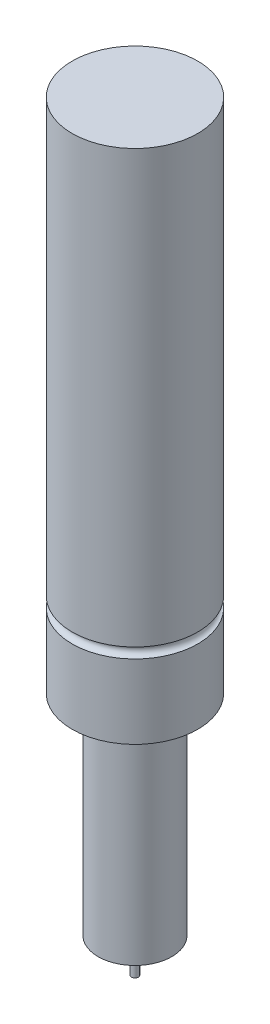
ISO-10303-21;
HEADER;
FILE_DESCRIPTION(('STEP AP214'),'2;1');
FILE_NAME('part.step','',(''),(''),'','','');
FILE_SCHEMA(('AUTOMOTIVE_DESIGN { 1 0 10303 214 1 1 1 1 }'));
ENDSEC;
DATA;
#1=APPLICATION_CONTEXT('core data for automotive mechanical design processes');
#2=APPLICATION_PROTOCOL_DEFINITION('international standard','automotive_design',2000,#1);
#3=PRODUCT_CONTEXT('',#1,'mechanical');
#4=PRODUCT('Part','Part','',(#3));
#5=PRODUCT_RELATED_PRODUCT_CATEGORY('part','',(#4));
#6=PRODUCT_DEFINITION_FORMATION('','',#4);
#7=PRODUCT_DEFINITION_CONTEXT('part definition',#1,'design');
#8=PRODUCT_DEFINITION('design','',#6,#7);
#9=PRODUCT_DEFINITION_SHAPE('','',#8);
#10=(LENGTH_UNIT() NAMED_UNIT(*) SI_UNIT(.MILLI.,.METRE.));
#11=(NAMED_UNIT(*) PLANE_ANGLE_UNIT() SI_UNIT($,.RADIAN.));
#12=(NAMED_UNIT(*) SI_UNIT($,.STERADIAN.) SOLID_ANGLE_UNIT());
#13=UNCERTAINTY_MEASURE_WITH_UNIT(LENGTH_MEASURE(1.E-05),#10,'distance_accuracy_value','');
#14=(GEOMETRIC_REPRESENTATION_CONTEXT(3) GLOBAL_UNCERTAINTY_ASSIGNED_CONTEXT((#13)) GLOBAL_UNIT_ASSIGNED_CONTEXT((#10,
#11,#12)) REPRESENTATION_CONTEXT('',''));
#15=CARTESIAN_POINT('',(0.,0.,0.));
#16=DIRECTION('',(0.,0.,1.));
#17=DIRECTION('',(1.,0.,0.));
#18=AXIS2_PLACEMENT_3D('',#15,#16,#17);
#19=CARTESIAN_POINT('',(0.,150.,0.));
#20=DIRECTION('',(0.,-1.,0.));
#21=DIRECTION('',(0.,0.,-1.));
#22=AXIS2_PLACEMENT_3D('',#19,#20,#21);
#23=CYLINDRICAL_SURFACE('',#22,18.25);
#24=CARTESIAN_POINT('',(0.,0.,0.));
#25=DIRECTION('',(0.,1.,0.));
#26=DIRECTION('',(0.,0.,1.));
#27=AXIS2_PLACEMENT_3D('',#24,#25,#26);
#28=CIRCLE('',#27,18.25);
#29=CARTESIAN_POINT('',(0.,0.,18.25));
#30=VERTEX_POINT('',#29);
#31=EDGE_CURVE('E66',#30,#30,#28,.T.);
#32=ORIENTED_EDGE('',*,*,#31,.T.);
#33=EDGE_LOOP('',(#32));
#34=FACE_BOUND('',#33,.T.);
#35=CARTESIAN_POINT('',(0.,21.5,0.));
#36=DIRECTION('',(0.,1.,0.));
#37=DIRECTION('',(0.,0.,1.));
#38=AXIS2_PLACEMENT_3D('',#35,#36,#37);
#39=CIRCLE('',#38,18.25);
#40=CARTESIAN_POINT('',(0.,21.5,18.25));
#41=VERTEX_POINT('',#40);
#42=EDGE_CURVE('E77',#41,#41,#39,.T.);
#43=ORIENTED_EDGE('',*,*,#42,.F.);
#44=EDGE_LOOP('',(#43));
#45=FACE_BOUND('',#44,.T.);
#46=ADVANCED_FACE('F45',(#34,#45),#23,.T.);
#47=CARTESIAN_POINT('',(0.,-61.,0.));
#48=DIRECTION('',(0.,1.,0.));
#49=DIRECTION('',(0.,0.,1.));
#50=AXIS2_PLACEMENT_3D('',#47,#48,#49);
#51=CYLINDRICAL_SURFACE('',#50,10.7);
#52=CARTESIAN_POINT('',(0.,-61.,0.));
#53=DIRECTION('',(0.,1.,0.));
#54=DIRECTION('',(0.,0.,1.));
#55=AXIS2_PLACEMENT_3D('',#52,#53,#54);
#56=CIRCLE('',#55,10.7);
#57=CARTESIAN_POINT('',(0.,-61.,10.7));
#58=VERTEX_POINT('',#57);
#59=EDGE_CURVE('E53',#58,#58,#56,.T.);
#60=ORIENTED_EDGE('',*,*,#59,.T.);
#61=EDGE_LOOP('',(#60));
#62=FACE_BOUND('',#61,.T.);
#63=CARTESIAN_POINT('',(0.,0.,0.));
#64=DIRECTION('',(0.,1.,0.));
#65=DIRECTION('',(0.,0.,1.));
#66=AXIS2_PLACEMENT_3D('',#63,#64,#65);
#67=CIRCLE('',#66,10.7);
#68=CARTESIAN_POINT('',(0.,0.,10.7));
#69=VERTEX_POINT('',#68);
#70=EDGE_CURVE('E58',#69,#69,#67,.T.);
#71=ORIENTED_EDGE('',*,*,#70,.F.);
#72=EDGE_LOOP('',(#71));
#73=FACE_BOUND('',#72,.T.);
#74=ADVANCED_FACE('F47',(#62,#73),#51,.T.);
#75=CARTESIAN_POINT('',(0.,-61.,0.));
#76=DIRECTION('',(0.,1.,0.));
#77=DIRECTION('',(0.,0.,1.));
#78=AXIS2_PLACEMENT_3D('',#75,#76,#77);
#79=PLANE('',#78);
#80=CARTESIAN_POINT('',(0.,-61.,0.));
#81=DIRECTION('',(0.,1.,0.));
#82=DIRECTION('',(0.,0.,1.));
#83=AXIS2_PLACEMENT_3D('',#80,#81,#82);
#84=CIRCLE('',#83,1.);
#85=CARTESIAN_POINT('',(0.,-61.,1.));
#86=VERTEX_POINT('',#85);
#87=EDGE_CURVE('E10',#86,#86,#84,.F.);
#88=ORIENTED_EDGE('',*,*,#87,.F.);
#89=EDGE_LOOP('',(#88));
#90=FACE_BOUND('',#89,.T.);
#91=ORIENTED_EDGE('',*,*,#59,.F.);
#92=EDGE_LOOP('',(#91));
#93=FACE_BOUND('',#92,.T.);
#94=ADVANCED_FACE('F109',(#90,#93),#79,.F.);
#95=CARTESIAN_POINT('',(0.,0.,0.));
#96=DIRECTION('',(0.,1.,0.));
#97=DIRECTION('',(0.,0.,1.));
#98=AXIS2_PLACEMENT_3D('',#95,#96,#97);
#99=PLANE('',#98);
#100=ORIENTED_EDGE('',*,*,#70,.T.);
#101=EDGE_LOOP('',(#100));
#102=FACE_BOUND('',#101,.T.);
#103=ORIENTED_EDGE('',*,*,#31,.F.);
#104=EDGE_LOOP('',(#103));
#105=FACE_BOUND('',#104,.T.);
#106=ADVANCED_FACE('F140',(#102,#105),#99,.F.);
#107=CARTESIAN_POINT('',(0.,-71.,0.));
#108=DIRECTION('',(0.,1.,0.));
#109=DIRECTION('',(0.,0.,1.));
#110=AXIS2_PLACEMENT_3D('',#107,#108,#109);
#111=CYLINDRICAL_SURFACE('',#110,1.);
#112=CARTESIAN_POINT('',(0.,-71.,0.));
#113=DIRECTION('',(0.,-1.,0.));
#114=DIRECTION('',(0.,0.,-1.));
#115=AXIS2_PLACEMENT_3D('',#112,#113,#114);
#116=CIRCLE('',#115,1.);
#117=CARTESIAN_POINT('',(0.,-71.,-1.));
#118=VERTEX_POINT('',#117);
#119=EDGE_CURVE('E70',#118,#118,#116,.T.);
#120=ORIENTED_EDGE('',*,*,#119,.F.);
#121=EDGE_LOOP('',(#120));
#122=FACE_BOUND('',#121,.T.);
#123=ORIENTED_EDGE('',*,*,#87,.T.);
#124=EDGE_LOOP('',(#123));
#125=FACE_BOUND('',#124,.T.);
#126=ADVANCED_FACE('F100',(#122,#125),#111,.T.);
#127=CARTESIAN_POINT('',(0.,-71.,0.));
#128=DIRECTION('',(0.,-1.,0.));
#129=DIRECTION('',(0.,0.,-1.));
#130=AXIS2_PLACEMENT_3D('',#127,#128,#129);
#131=PLANE('',#130);
#132=ORIENTED_EDGE('',*,*,#119,.T.);
#133=EDGE_LOOP('',(#132));
#134=FACE_BOUND('',#133,.T.);
#135=ADVANCED_FACE('F91',(#134),#131,.T.);
#136=CARTESIAN_POINT('',(0.,23.,0.));
#137=DIRECTION('',(0.,1.,0.));
#138=DIRECTION('',(0.,0.,1.));
#139=AXIS2_PLACEMENT_3D('',#136,#137,#138);
#140=TOROIDAL_SURFACE('',#139,18.25,1.5);
#141=ORIENTED_EDGE('',*,*,#42,.T.);
#142=EDGE_LOOP('',(#141));
#143=FACE_BOUND('',#142,.T.);
#144=CARTESIAN_POINT('',(0.,24.5,0.));
#145=DIRECTION('',(0.,1.,0.));
#146=DIRECTION('',(0.,0.,1.));
#147=AXIS2_PLACEMENT_3D('',#144,#145,#146);
#148=CIRCLE('',#147,18.25);
#149=CARTESIAN_POINT('',(0.,24.5,18.25));
#150=VERTEX_POINT('',#149);
#151=EDGE_CURVE('E81',#150,#150,#148,.T.);
#152=ORIENTED_EDGE('',*,*,#151,.F.);
#153=EDGE_LOOP('',(#152));
#154=FACE_BOUND('',#153,.T.);
#155=ADVANCED_FACE('F88',(#143,#154),#140,.F.);
#156=CARTESIAN_POINT('',(0.,150.,0.));
#157=DIRECTION('',(0.,1.,0.));
#158=DIRECTION('',(0.,0.,1.));
#159=AXIS2_PLACEMENT_3D('',#156,#157,#158);
#160=PLANE('',#159);
#161=CARTESIAN_POINT('',(0.,150.,0.));
#162=DIRECTION('',(0.,1.,0.));
#163=DIRECTION('',(0.,0.,1.));
#164=AXIS2_PLACEMENT_3D('',#161,#162,#163);
#165=CIRCLE('',#164,18.25);
#166=CARTESIAN_POINT('',(0.,150.,18.25));
#167=VERTEX_POINT('',#166);
#168=EDGE_CURVE('E64',#167,#167,#165,.T.);
#169=ORIENTED_EDGE('',*,*,#168,.T.);
#170=EDGE_LOOP('',(#169));
#171=FACE_BOUND('',#170,.T.);
#172=ADVANCED_FACE('F90',(#171),#160,.T.);
#173=ORIENTED_EDGE('',*,*,#168,.F.);
#174=EDGE_LOOP('',(#173));
#175=FACE_BOUND('',#174,.T.);
#176=ORIENTED_EDGE('',*,*,#151,.T.);
#177=EDGE_LOOP('',(#176));
#178=FACE_BOUND('',#177,.T.);
#179=ADVANCED_FACE('F86',(#175,#178),#23,.T.);
#180=CLOSED_SHELL('',(#46,#74,#94,#106,#126,#135,#155,#172,#179));
#181=MANIFOLD_SOLID_BREP('B2',#180);
#182=ADVANCED_BREP_SHAPE_REPRESENTATION('',(#18,#181),#14);
#183=SHAPE_DEFINITION_REPRESENTATION(#9,#182);
ENDSEC;
END-ISO-10303-21;
